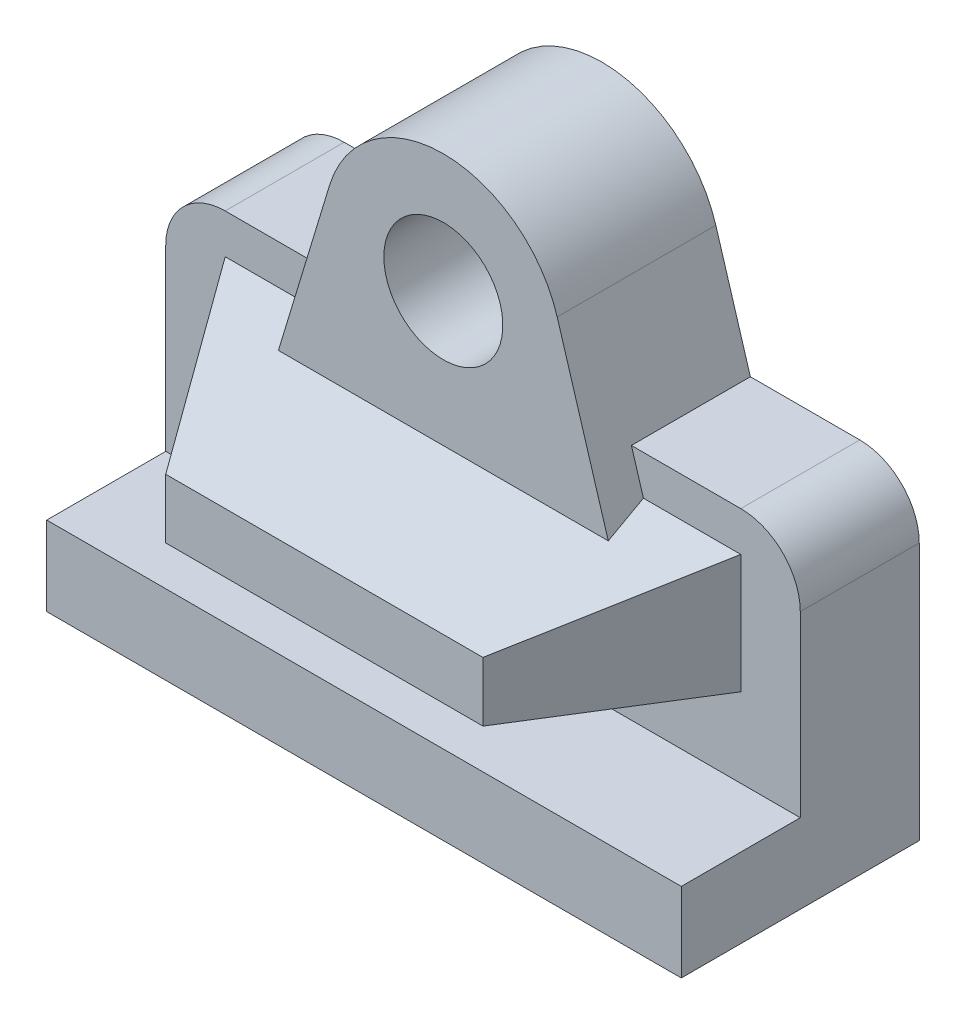
ISO-10303-21;
HEADER;
FILE_DESCRIPTION(('STEP AP214'),'2;1');
FILE_NAME('part.step','',(''),(''),'','','');
FILE_SCHEMA(('AUTOMOTIVE_DESIGN { 1 0 10303 214 1 1 1 1 }'));
ENDSEC;
DATA;
#1=APPLICATION_CONTEXT('core data for automotive mechanical design processes');
#2=APPLICATION_PROTOCOL_DEFINITION('international standard','automotive_design',2000,#1);
#3=PRODUCT_CONTEXT('',#1,'mechanical');
#4=PRODUCT('Part','Part','',(#3));
#5=PRODUCT_RELATED_PRODUCT_CATEGORY('part','',(#4));
#6=PRODUCT_DEFINITION_FORMATION('','',#4);
#7=PRODUCT_DEFINITION_CONTEXT('part definition',#1,'design');
#8=PRODUCT_DEFINITION('design','',#6,#7);
#9=PRODUCT_DEFINITION_SHAPE('','',#8);
#10=(LENGTH_UNIT() NAMED_UNIT(*) SI_UNIT(.MILLI.,.METRE.));
#11=(NAMED_UNIT(*) PLANE_ANGLE_UNIT() SI_UNIT($,.RADIAN.));
#12=(NAMED_UNIT(*) SI_UNIT($,.STERADIAN.) SOLID_ANGLE_UNIT());
#13=UNCERTAINTY_MEASURE_WITH_UNIT(LENGTH_MEASURE(1.E-05),#10,'distance_accuracy_value','');
#14=(GEOMETRIC_REPRESENTATION_CONTEXT(3) GLOBAL_UNCERTAINTY_ASSIGNED_CONTEXT((#13)) GLOBAL_UNIT_ASSIGNED_CONTEXT((#10,
#11,#12)) REPRESENTATION_CONTEXT('',''));
#15=CARTESIAN_POINT('',(0.,0.,0.));
#16=DIRECTION('',(0.,0.,1.));
#17=DIRECTION('',(1.,0.,0.));
#18=AXIS2_PLACEMENT_3D('',#15,#16,#17);
#19=CARTESIAN_POINT('',(-35.8686510918962,10.8802906407689,19.05));
#20=DIRECTION('',(0.956942897795657,-0.29027623112899,0.));
#21=DIRECTION('',(0.29027623112899,0.956942897795657,0.));
#22=AXIS2_PLACEMENT_3D('',#19,#20,#21);
#23=PLANE('',#22);
#24=DIRECTION('',(0.105909715480469,0.349148635568292,-0.931063028182113));
#25=VECTOR('',#24,1.);
#26=CARTESIAN_POINT('',(-27.0412838186963,39.9811453179426,30.9669458188198));
#27=LINE('',#26,#25);
#28=CARTESIAN_POINT('',(-26.4080359827065,42.06875,25.4));
#29=VERTEX_POINT('',#28);
#30=CARTESIAN_POINT('',(-25.6857146436087,44.45,19.05));
#31=VERTEX_POINT('',#30);
#32=EDGE_CURVE('E291',#29,#31,#27,.T.);
#33=ORIENTED_EDGE('',*,*,#32,.F.);
#34=DIRECTION('',(-0.29027623112899,-0.956942897795657,0.));
#35=VECTOR('',#34,1.);
#36=CARTESIAN_POINT('',(-35.8686510918962,10.8802906407689,25.4));
#37=LINE('',#36,#35);
#38=CARTESIAN_POINT('',(-18.2297622030073,69.0297622030073,25.4));
#39=VERTEX_POINT('',#38);
#40=EDGE_CURVE('E267',#39,#29,#37,.T.);
#41=ORIENTED_EDGE('',*,*,#40,.F.);
#42=DIRECTION('',(0.,0.,-1.));
#43=VECTOR('',#42,1.);
#44=CARTESIAN_POINT('',(-18.2297622030073,69.0297622030073,19.05));
#45=LINE('',#44,#43);
#46=CARTESIAN_POINT('',(-18.2297622030073,69.0297622030073,0.));
#47=VERTEX_POINT('',#46);
#48=EDGE_CURVE('E152',#39,#47,#45,.T.);
#49=ORIENTED_EDGE('',*,*,#48,.T.);
#50=DIRECTION('',(-0.29027623112899,-0.956942897795657,0.));
#51=VECTOR('',#50,1.);
#52=CARTESIAN_POINT('',(-35.8686510918962,10.8802906407689,0.));
#53=LINE('',#52,#51);
#54=CARTESIAN_POINT('',(-23.7595244060145,50.8,0.));
#55=VERTEX_POINT('',#54);
#56=EDGE_CURVE('E158',#47,#55,#53,.T.);
#57=ORIENTED_EDGE('',*,*,#56,.T.);
#58=DIRECTION('',(0.,0.,-1.));
#59=VECTOR('',#58,1.);
#60=CARTESIAN_POINT('',(-23.7595244060145,50.8,19.05));
#61=LINE('',#60,#59);
#62=CARTESIAN_POINT('',(-23.7595244060145,50.8,19.05));
#63=VERTEX_POINT('',#62);
#64=EDGE_CURVE('E51',#63,#55,#61,.T.);
#65=ORIENTED_EDGE('',*,*,#64,.F.);
#66=DIRECTION('',(0.29027623112899,0.956942897795657,0.));
#67=VECTOR('',#66,1.);
#68=CARTESIAN_POINT('',(-35.8686510918962,10.8802906407689,19.05));
#69=LINE('',#68,#67);
#70=EDGE_CURVE('E108',#31,#63,#69,.T.);
#71=ORIENTED_EDGE('',*,*,#70,.F.);
#72=EDGE_LOOP('',(#33,#41,#49,#57,#65,#71));
#73=FACE_BOUND('',#72,.T.);
#74=ADVANCED_FACE('F43',(#73),#23,.F.);
#75=CARTESIAN_POINT('',(35.8686510918962,10.8802906407689,19.05));
#76=DIRECTION('',(0.956942897795657,0.29027623112899,0.));
#77=DIRECTION('',(-0.29027623112899,0.956942897795657,0.));
#78=AXIS2_PLACEMENT_3D('',#75,#76,#77);
#79=PLANE('',#78);
#80=DIRECTION('',(0.29027623112899,-0.956942897795657,0.));
#81=VECTOR('',#80,1.);
#82=CARTESIAN_POINT('',(35.8686510918962,10.8802906407689,25.4));
#83=LINE('',#82,#81);
#84=CARTESIAN_POINT('',(18.2297622030073,69.0297622030073,25.4));
#85=VERTEX_POINT('',#84);
#86=CARTESIAN_POINT('',(26.4080359827065,42.06875,25.4));
#87=VERTEX_POINT('',#86);
#88=EDGE_CURVE('E256',#85,#87,#83,.T.);
#89=ORIENTED_EDGE('',*,*,#88,.T.);
#90=DIRECTION('',(-0.105909715480469,0.349148635568292,-0.931063028182113));
#91=VECTOR('',#90,1.);
#92=CARTESIAN_POINT('',(27.0412838186963,39.9811453179426,30.9669458188198));
#93=LINE('',#92,#91);
#94=CARTESIAN_POINT('',(25.6857146436087,44.45,19.05));
#95=VERTEX_POINT('',#94);
#96=EDGE_CURVE('E59',#87,#95,#93,.T.);
#97=ORIENTED_EDGE('',*,*,#96,.T.);
#98=DIRECTION('',(-0.29027623112899,0.956942897795657,0.));
#99=VECTOR('',#98,1.);
#100=CARTESIAN_POINT('',(35.8686510918962,10.8802906407689,19.05));
#101=LINE('',#100,#99);
#102=CARTESIAN_POINT('',(23.7595244060145,50.8,19.05));
#103=VERTEX_POINT('',#102);
#104=EDGE_CURVE('E66',#95,#103,#101,.T.);
#105=ORIENTED_EDGE('',*,*,#104,.T.);
#106=DIRECTION('',(0.,0.,-1.));
#107=VECTOR('',#106,1.);
#108=CARTESIAN_POINT('',(23.7595244060145,50.8,19.05));
#109=LINE('',#108,#107);
#110=CARTESIAN_POINT('',(23.7595244060145,50.8,0.));
#111=VERTEX_POINT('',#110);
#112=EDGE_CURVE('E187',#103,#111,#109,.T.);
#113=ORIENTED_EDGE('',*,*,#112,.T.);
#114=DIRECTION('',(0.29027623112899,-0.956942897795657,0.));
#115=VECTOR('',#114,1.);
#116=CARTESIAN_POINT('',(35.8686510918962,10.8802906407689,0.));
#117=LINE('',#116,#115);
#118=CARTESIAN_POINT('',(18.2297622030073,69.0297622030073,0.));
#119=VERTEX_POINT('',#118);
#120=EDGE_CURVE('E176',#119,#111,#117,.T.);
#121=ORIENTED_EDGE('',*,*,#120,.F.);
#122=DIRECTION('',(0.,0.,-1.));
#123=VECTOR('',#122,1.);
#124=CARTESIAN_POINT('',(18.2297622030073,69.0297622030073,19.05));
#125=LINE('',#124,#123);
#126=EDGE_CURVE('E185',#85,#119,#125,.T.);
#127=ORIENTED_EDGE('',*,*,#126,.F.);
#128=EDGE_LOOP('',(#89,#97,#105,#113,#121,#127));
#129=FACE_BOUND('',#128,.T.);
#130=ADVANCED_FACE('F461',(#129),#79,.T.);
#131=CARTESIAN_POINT('',(0.,0.,19.05));
#132=DIRECTION('',(0.,0.,1.));
#133=DIRECTION('',(1.,0.,0.));
#134=AXIS2_PLACEMENT_3D('',#131,#132,#133);
#135=PLANE('',#134);
#136=DIRECTION('',(0.,-1.,0.));
#137=VECTOR('',#136,1.);
#138=CARTESIAN_POINT('',(-41.275,44.45,19.05));
#139=LINE('',#138,#137);
#140=CARTESIAN_POINT('',(-41.275,44.45,19.05));
#141=VERTEX_POINT('',#140);
#142=CARTESIAN_POINT('',(-41.275,25.4,19.05));
#143=VERTEX_POINT('',#142);
#144=EDGE_CURVE('E343',#141,#143,#139,.T.);
#145=ORIENTED_EDGE('',*,*,#144,.F.);
#146=DIRECTION('',(-1.,0.,0.));
#147=VECTOR('',#146,1.);
#148=CARTESIAN_POINT('',(-41.275,44.45,19.05));
#149=LINE('',#148,#147);
#150=EDGE_CURVE('E332',#31,#141,#149,.T.);
#151=ORIENTED_EDGE('',*,*,#150,.F.);
#152=ORIENTED_EDGE('',*,*,#70,.T.);
#153=DIRECTION('',(1.,0.,0.));
#154=VECTOR('',#153,1.);
#155=CARTESIAN_POINT('',(0.,50.8,19.05));
#156=LINE('',#155,#154);
#157=CARTESIAN_POINT('',(-41.275,50.8,19.05));
#158=VERTEX_POINT('',#157);
#159=EDGE_CURVE('E183',#158,#63,#156,.T.);
#160=ORIENTED_EDGE('',*,*,#159,.F.);
#161=CARTESIAN_POINT('',(-41.275,41.275,19.05));
#162=DIRECTION('',(0.,0.,1.));
#163=DIRECTION('',(1.,0.,0.));
#164=AXIS2_PLACEMENT_3D('',#161,#162,#163);
#165=CIRCLE('',#164,9.525);
#166=CARTESIAN_POINT('',(-50.8,41.275,19.05));
#167=VERTEX_POINT('',#166);
#168=EDGE_CURVE('E198',#167,#158,#165,.F.);
#169=ORIENTED_EDGE('',*,*,#168,.F.);
#170=DIRECTION('',(0.,1.,0.));
#171=VECTOR('',#170,1.);
#172=CARTESIAN_POINT('',(-50.8,0.,19.05));
#173=LINE('',#172,#171);
#174=CARTESIAN_POINT('',(-50.8,12.7,19.05));
#175=VERTEX_POINT('',#174);
#176=EDGE_CURVE('E195',#175,#167,#173,.T.);
#177=ORIENTED_EDGE('',*,*,#176,.F.);
#178=DIRECTION('',(-1.,0.,0.));
#179=VECTOR('',#178,1.);
#180=CARTESIAN_POINT('',(0.,12.7,19.05));
#181=LINE('',#180,#179);
#182=CARTESIAN_POINT('',(50.8,12.7,19.05));
#183=VERTEX_POINT('',#182);
#184=EDGE_CURVE('E131',#183,#175,#181,.T.);
#185=ORIENTED_EDGE('',*,*,#184,.F.);
#186=DIRECTION('',(0.,1.,0.));
#187=VECTOR('',#186,1.);
#188=CARTESIAN_POINT('',(50.8,0.,19.05));
#189=LINE('',#188,#187);
#190=CARTESIAN_POINT('',(50.8,41.275,19.05));
#191=VERTEX_POINT('',#190);
#192=EDGE_CURVE('E122',#183,#191,#189,.T.);
#193=ORIENTED_EDGE('',*,*,#192,.T.);
#194=CARTESIAN_POINT('',(41.275,41.275,19.05));
#195=DIRECTION('',(0.,0.,1.));
#196=DIRECTION('',(1.,0.,0.));
#197=AXIS2_PLACEMENT_3D('',#194,#195,#196);
#198=CIRCLE('',#197,9.525);
#199=CARTESIAN_POINT('',(41.275,50.8,19.05));
#200=VERTEX_POINT('',#199);
#201=EDGE_CURVE('E127',#191,#200,#198,.T.);
#202=ORIENTED_EDGE('',*,*,#201,.T.);
#203=DIRECTION('',(-1.,0.,0.));
#204=VECTOR('',#203,1.);
#205=CARTESIAN_POINT('',(0.,50.8,19.05));
#206=LINE('',#205,#204);
#207=EDGE_CURVE('E150',#200,#103,#206,.T.);
#208=ORIENTED_EDGE('',*,*,#207,.T.);
#209=ORIENTED_EDGE('',*,*,#104,.F.);
#210=CARTESIAN_POINT('',(41.275,44.45,19.05));
#211=VERTEX_POINT('',#210);
#212=EDGE_CURVE('E337',#211,#95,#149,.T.);
#213=ORIENTED_EDGE('',*,*,#212,.F.);
#214=DIRECTION('',(0.,1.,0.));
#215=VECTOR('',#214,1.);
#216=CARTESIAN_POINT('',(41.275,25.4,19.05));
#217=LINE('',#216,#215);
#218=CARTESIAN_POINT('',(41.275,25.4,19.05));
#219=VERTEX_POINT('',#218);
#220=EDGE_CURVE('E338',#219,#211,#217,.T.);
#221=ORIENTED_EDGE('',*,*,#220,.F.);
#222=DIRECTION('',(1.,0.,0.));
#223=VECTOR('',#222,1.);
#224=CARTESIAN_POINT('',(-41.275,25.4,19.05));
#225=LINE('',#224,#223);
#226=EDGE_CURVE('E353',#143,#219,#225,.T.);
#227=ORIENTED_EDGE('',*,*,#226,.F.);
#228=EDGE_LOOP('',(#145,#151,#152,#160,#169,#177,#185,#193,#202,#208,#209,#213,#221,#227));
#229=FACE_BOUND('',#228,.T.);
#230=ADVANCED_FACE('F125',(#229),#135,.T.);
#231=CARTESIAN_POINT('',(0.,0.,25.4));
#232=DIRECTION('',(0.,0.,1.));
#233=DIRECTION('',(1.,0.,0.));
#234=AXIS2_PLACEMENT_3D('',#231,#232,#233);
#235=PLANE('',#234);
#236=CARTESIAN_POINT('',(0.,63.5,25.4));
#237=DIRECTION('',(0.,0.,1.));
#238=DIRECTION('',(1.,0.,0.));
#239=AXIS2_PLACEMENT_3D('',#236,#237,#238);
#240=CIRCLE('',#239,9.52500000000001);
#241=CARTESIAN_POINT('',(-9.52500000000001,63.5,25.4));
#242=VERTEX_POINT('',#241);
#243=EDGE_CURVE('E271',#242,#242,#240,.T.);
#244=ORIENTED_EDGE('',*,*,#243,.F.);
#245=EDGE_LOOP('',(#244));
#246=FACE_BOUND('',#245,.T.);
#247=ORIENTED_EDGE('',*,*,#40,.T.);
#248=DIRECTION('',(1.,0.,0.));
#249=VECTOR('',#248,1.);
#250=CARTESIAN_POINT('',(0.,42.06875,25.4));
#251=LINE('',#250,#249);
#252=EDGE_CURVE('E12',#29,#87,#251,.T.);
#253=ORIENTED_EDGE('',*,*,#252,.T.);
#254=ORIENTED_EDGE('',*,*,#88,.F.);
#255=CARTESIAN_POINT('',(0.,63.5,25.4));
#256=DIRECTION('',(0.,0.,1.));
#257=DIRECTION('',(1.,0.,0.));
#258=AXIS2_PLACEMENT_3D('',#255,#256,#257);
#259=CIRCLE('',#258,19.05);
#260=EDGE_CURVE('E263',#85,#39,#259,.T.);
#261=ORIENTED_EDGE('',*,*,#260,.T.);
#262=EDGE_LOOP('',(#247,#253,#254,#261));
#263=FACE_BOUND('',#262,.T.);
#264=ADVANCED_FACE('F277',(#246,#263),#235,.T.);
#265=CARTESIAN_POINT('',(0.,50.8,19.05));
#266=DIRECTION('',(0.,1.,0.));
#267=DIRECTION('',(0.,0.,1.));
#268=AXIS2_PLACEMENT_3D('',#265,#266,#267);
#269=PLANE('',#268);
#270=DIRECTION('',(1.,0.,0.));
#271=VECTOR('',#270,1.);
#272=CARTESIAN_POINT('',(0.,50.8,0.));
#273=LINE('',#272,#271);
#274=CARTESIAN_POINT('',(-41.275,50.8,0.));
#275=VERTEX_POINT('',#274);
#276=EDGE_CURVE('E161',#275,#55,#273,.T.);
#277=ORIENTED_EDGE('',*,*,#276,.F.);
#278=DIRECTION('',(0.,0.,-1.));
#279=VECTOR('',#278,1.);
#280=CARTESIAN_POINT('',(-41.275,50.8,19.05));
#281=LINE('',#280,#279);
#282=EDGE_CURVE('E191',#158,#275,#281,.T.);
#283=ORIENTED_EDGE('',*,*,#282,.F.);
#284=ORIENTED_EDGE('',*,*,#159,.T.);
#285=ORIENTED_EDGE('',*,*,#64,.T.);
#286=EDGE_LOOP('',(#277,#283,#284,#285));
#287=FACE_BOUND('',#286,.T.);
#288=ADVANCED_FACE('F280',(#287),#269,.T.);
#289=CARTESIAN_POINT('',(-41.275,41.275,19.05));
#290=DIRECTION('',(0.,0.,-1.));
#291=DIRECTION('',(-1.,0.,0.));
#292=AXIS2_PLACEMENT_3D('',#289,#290,#291);
#293=CYLINDRICAL_SURFACE('',#292,9.525);
#294=CARTESIAN_POINT('',(-41.275,41.275,0.));
#295=DIRECTION('',(0.,0.,1.));
#296=DIRECTION('',(1.,0.,0.));
#297=AXIS2_PLACEMENT_3D('',#294,#295,#296);
#298=CIRCLE('',#297,9.525);
#299=CARTESIAN_POINT('',(-50.8,41.275,0.));
#300=VERTEX_POINT('',#299);
#301=EDGE_CURVE('E164',#300,#275,#298,.F.);
#302=ORIENTED_EDGE('',*,*,#301,.F.);
#303=DIRECTION('',(0.,0.,-1.));
#304=VECTOR('',#303,1.);
#305=CARTESIAN_POINT('',(-50.8,41.275,19.05));
#306=LINE('',#305,#304);
#307=EDGE_CURVE('E144',#167,#300,#306,.T.);
#308=ORIENTED_EDGE('',*,*,#307,.F.);
#309=ORIENTED_EDGE('',*,*,#168,.T.);
#310=ORIENTED_EDGE('',*,*,#282,.T.);
#311=EDGE_LOOP('',(#302,#308,#309,#310));
#312=FACE_BOUND('',#311,.T.);
#313=ADVANCED_FACE('F216',(#312),#293,.T.);
#314=CARTESIAN_POINT('',(-50.8,0.,19.05));
#315=DIRECTION('',(-1.,0.,0.));
#316=DIRECTION('',(0.,0.,1.));
#317=AXIS2_PLACEMENT_3D('',#314,#315,#316);
#318=PLANE('',#317);
#319=DIRECTION('',(0.,1.,0.));
#320=VECTOR('',#319,1.);
#321=CARTESIAN_POINT('',(-50.8,0.,0.));
#322=LINE('',#321,#320);
#323=CARTESIAN_POINT('',(-50.8,0.,0.));
#324=VERTEX_POINT('',#323);
#325=EDGE_CURVE('E167',#324,#300,#322,.T.);
#326=ORIENTED_EDGE('',*,*,#325,.F.);
#327=DIRECTION('',(0.,0.,-1.));
#328=VECTOR('',#327,1.);
#329=CARTESIAN_POINT('',(-50.8,0.,38.1));
#330=LINE('',#329,#328);
#331=CARTESIAN_POINT('',(-50.8,0.,38.1));
#332=VERTEX_POINT('',#331);
#333=EDGE_CURVE('E244',#332,#324,#330,.T.);
#334=ORIENTED_EDGE('',*,*,#333,.F.);
#335=DIRECTION('',(0.,1.,0.));
#336=VECTOR('',#335,1.);
#337=CARTESIAN_POINT('',(-50.8,0.,38.1));
#338=LINE('',#337,#336);
#339=CARTESIAN_POINT('',(-50.8,12.7,38.1));
#340=VERTEX_POINT('',#339);
#341=EDGE_CURVE('E229',#332,#340,#338,.T.);
#342=ORIENTED_EDGE('',*,*,#341,.T.);
#343=DIRECTION('',(0.,0.,-1.));
#344=VECTOR('',#343,1.);
#345=CARTESIAN_POINT('',(-50.8,12.7,38.1));
#346=LINE('',#345,#344);
#347=EDGE_CURVE('E225',#340,#175,#346,.T.);
#348=ORIENTED_EDGE('',*,*,#347,.T.);
#349=ORIENTED_EDGE('',*,*,#176,.T.);
#350=ORIENTED_EDGE('',*,*,#307,.T.);
#351=EDGE_LOOP('',(#326,#334,#342,#348,#349,#350));
#352=FACE_BOUND('',#351,.T.);
#353=ADVANCED_FACE('F222',(#352),#318,.T.);
#354=CARTESIAN_POINT('',(50.8,0.,19.05));
#355=DIRECTION('',(-1.,0.,0.));
#356=DIRECTION('',(0.,0.,1.));
#357=AXIS2_PLACEMENT_3D('',#354,#355,#356);
#358=PLANE('',#357);
#359=DIRECTION('',(0.,1.,0.));
#360=VECTOR('',#359,1.);
#361=CARTESIAN_POINT('',(50.8,0.,0.));
#362=LINE('',#361,#360);
#363=CARTESIAN_POINT('',(50.8,0.,0.));
#364=VERTEX_POINT('',#363);
#365=CARTESIAN_POINT('',(50.8,41.275,0.));
#366=VERTEX_POINT('',#365);
#367=EDGE_CURVE('E141',#364,#366,#362,.T.);
#368=ORIENTED_EDGE('',*,*,#367,.T.);
#369=DIRECTION('',(0.,0.,-1.));
#370=VECTOR('',#369,1.);
#371=CARTESIAN_POINT('',(50.8,41.275,19.05));
#372=LINE('',#371,#370);
#373=EDGE_CURVE('E137',#191,#366,#372,.T.);
#374=ORIENTED_EDGE('',*,*,#373,.F.);
#375=ORIENTED_EDGE('',*,*,#192,.F.);
#376=DIRECTION('',(0.,0.,-1.));
#377=VECTOR('',#376,1.);
#378=CARTESIAN_POINT('',(50.8,12.7,38.1));
#379=LINE('',#378,#377);
#380=CARTESIAN_POINT('',(50.8,12.7,38.1));
#381=VERTEX_POINT('',#380);
#382=EDGE_CURVE('E234',#381,#183,#379,.T.);
#383=ORIENTED_EDGE('',*,*,#382,.F.);
#384=DIRECTION('',(0.,1.,0.));
#385=VECTOR('',#384,1.);
#386=CARTESIAN_POINT('',(50.8,0.,38.1));
#387=LINE('',#386,#385);
#388=CARTESIAN_POINT('',(50.8,0.,38.1));
#389=VERTEX_POINT('',#388);
#390=EDGE_CURVE('E240',#389,#381,#387,.T.);
#391=ORIENTED_EDGE('',*,*,#390,.F.);
#392=DIRECTION('',(0.,0.,-1.));
#393=VECTOR('',#392,1.);
#394=CARTESIAN_POINT('',(50.8,0.,38.1));
#395=LINE('',#394,#393);
#396=EDGE_CURVE('E237',#389,#364,#395,.T.);
#397=ORIENTED_EDGE('',*,*,#396,.T.);
#398=EDGE_LOOP('',(#368,#374,#375,#383,#391,#397));
#399=FACE_BOUND('',#398,.T.);
#400=ADVANCED_FACE('F138',(#399),#358,.F.);
#401=CARTESIAN_POINT('',(41.275,41.275,19.05));
#402=DIRECTION('',(0.,0.,-1.));
#403=DIRECTION('',(-1.,0.,0.));
#404=AXIS2_PLACEMENT_3D('',#401,#402,#403);
#405=CYLINDRICAL_SURFACE('',#404,9.525);
#406=CARTESIAN_POINT('',(41.275,41.275,0.));
#407=DIRECTION('',(0.,0.,1.));
#408=DIRECTION('',(1.,0.,0.));
#409=AXIS2_PLACEMENT_3D('',#406,#407,#408);
#410=CIRCLE('',#409,9.525);
#411=CARTESIAN_POINT('',(41.275,50.8,0.));
#412=VERTEX_POINT('',#411);
#413=EDGE_CURVE('E171',#366,#412,#410,.T.);
#414=ORIENTED_EDGE('',*,*,#413,.T.);
#415=DIRECTION('',(0.,0.,-1.));
#416=VECTOR('',#415,1.);
#417=CARTESIAN_POINT('',(41.275,50.8,19.05));
#418=LINE('',#417,#416);
#419=EDGE_CURVE('E145',#200,#412,#418,.T.);
#420=ORIENTED_EDGE('',*,*,#419,.F.);
#421=ORIENTED_EDGE('',*,*,#201,.F.);
#422=ORIENTED_EDGE('',*,*,#373,.T.);
#423=EDGE_LOOP('',(#414,#420,#421,#422));
#424=FACE_BOUND('',#423,.T.);
#425=ADVANCED_FACE('F147',(#424),#405,.T.);
#426=CARTESIAN_POINT('',(0.,50.8,19.05));
#427=DIRECTION('',(0.,-1.,0.));
#428=DIRECTION('',(0.,0.,-1.));
#429=AXIS2_PLACEMENT_3D('',#426,#427,#428);
#430=PLANE('',#429);
#431=DIRECTION('',(-1.,0.,0.));
#432=VECTOR('',#431,1.);
#433=CARTESIAN_POINT('',(0.,50.8,0.));
#434=LINE('',#433,#432);
#435=EDGE_CURVE('E173',#412,#111,#434,.T.);
#436=ORIENTED_EDGE('',*,*,#435,.T.);
#437=ORIENTED_EDGE('',*,*,#112,.F.);
#438=ORIENTED_EDGE('',*,*,#207,.F.);
#439=ORIENTED_EDGE('',*,*,#419,.T.);
#440=EDGE_LOOP('',(#436,#437,#438,#439));
#441=FACE_BOUND('',#440,.T.);
#442=ADVANCED_FACE('F474',(#441),#430,.F.);
#443=CARTESIAN_POINT('',(0.,63.5,19.05));
#444=DIRECTION('',(0.,0.,-1.));
#445=DIRECTION('',(-1.,0.,0.));
#446=AXIS2_PLACEMENT_3D('',#443,#444,#445);
#447=CYLINDRICAL_SURFACE('',#446,19.05);
#448=CARTESIAN_POINT('',(0.,63.5,0.));
#449=DIRECTION('',(0.,0.,1.));
#450=DIRECTION('',(1.,0.,0.));
#451=AXIS2_PLACEMENT_3D('',#448,#449,#450);
#452=CIRCLE('',#451,19.05);
#453=EDGE_CURVE('E99',#119,#47,#452,.T.);
#454=ORIENTED_EDGE('',*,*,#453,.T.);
#455=ORIENTED_EDGE('',*,*,#48,.F.);
#456=ORIENTED_EDGE('',*,*,#260,.F.);
#457=ORIENTED_EDGE('',*,*,#126,.T.);
#458=EDGE_LOOP('',(#454,#455,#456,#457));
#459=FACE_BOUND('',#458,.T.);
#460=ADVANCED_FACE('F472',(#459),#447,.T.);
#461=CARTESIAN_POINT('',(0.,63.5,19.05));
#462=DIRECTION('',(0.,0.,-1.));
#463=DIRECTION('',(-1.,0.,0.));
#464=AXIS2_PLACEMENT_3D('',#461,#462,#463);
#465=CYLINDRICAL_SURFACE('',#464,9.52500000000001);
#466=CARTESIAN_POINT('',(0.,63.5,0.));
#467=DIRECTION('',(0.,0.,1.));
#468=DIRECTION('',(1.,0.,0.));
#469=AXIS2_PLACEMENT_3D('',#466,#467,#468);
#470=CIRCLE('',#469,9.52500000000001);
#471=CARTESIAN_POINT('',(-9.52500000000001,63.5,0.));
#472=VERTEX_POINT('',#471);
#473=EDGE_CURVE('E180',#472,#472,#470,.T.);
#474=CARTESIAN_POINT('',(-9.52500000000001,63.5,0.));
#475=CARTESIAN_POINT('',(-9.52500000000001,63.5,0.264583333333333));
#476=CARTESIAN_POINT('',(-9.52500000000001,63.5,0.529166666666666));
#477=CARTESIAN_POINT('',(-9.52500000000001,63.5,1.05833333333333));
#478=CARTESIAN_POINT('',(-9.52500000000001,63.5,1.32291666666667));
#479=CARTESIAN_POINT('',(-9.52500000000001,63.5,1.85208333333333));
#480=CARTESIAN_POINT('',(-9.52500000000001,63.5,2.11666666666667));
#481=CARTESIAN_POINT('',(-9.52500000000001,63.5,2.64583333333333));
#482=CARTESIAN_POINT('',(-9.52500000000001,63.5,2.91041666666667));
#483=CARTESIAN_POINT('',(-9.52500000000001,63.5,3.43958333333333));
#484=CARTESIAN_POINT('',(-9.52500000000001,63.5,3.70416666666667));
#485=CARTESIAN_POINT('',(-9.52500000000001,63.5,4.23333333333333));
#486=CARTESIAN_POINT('',(-9.52500000000001,63.5,4.49791666666667));
#487=CARTESIAN_POINT('',(-9.52500000000001,63.5,5.02708333333333));
#488=CARTESIAN_POINT('',(-9.52500000000001,63.5,5.29166666666666));
#489=CARTESIAN_POINT('',(-9.52500000000001,63.5,5.82083333333333));
#490=CARTESIAN_POINT('',(-9.52500000000001,63.5,6.08541666666666));
#491=CARTESIAN_POINT('',(-9.52500000000001,63.5,6.61458333333333));
#492=CARTESIAN_POINT('',(-9.52500000000001,63.5,6.87916666666667));
#493=CARTESIAN_POINT('',(-9.52500000000001,63.5,7.40833333333333));
#494=CARTESIAN_POINT('',(-9.52500000000001,63.5,7.67291666666667));
#495=CARTESIAN_POINT('',(-9.52500000000001,63.5,8.20208333333333));
#496=CARTESIAN_POINT('',(-9.52500000000001,63.5,8.46666666666666));
#497=CARTESIAN_POINT('',(-9.52500000000001,63.5,8.99583333333333));
#498=CARTESIAN_POINT('',(-9.52500000000001,63.5,9.26041666666666));
#499=CARTESIAN_POINT('',(-9.52500000000001,63.5,9.78958333333333));
#500=CARTESIAN_POINT('',(-9.52500000000001,63.5,10.0541666666667));
#501=CARTESIAN_POINT('',(-9.52500000000001,63.5,10.5833333333333));
#502=CARTESIAN_POINT('',(-9.52500000000001,63.5,10.8479166666667));
#503=CARTESIAN_POINT('',(-9.52500000000001,63.5,11.3770833333333));
#504=CARTESIAN_POINT('',(-9.52500000000001,63.5,11.6416666666667));
#505=CARTESIAN_POINT('',(-9.52500000000001,63.5,12.1708333333333));
#506=CARTESIAN_POINT('',(-9.52500000000001,63.5,12.4354166666667));
#507=CARTESIAN_POINT('',(-9.52500000000001,63.5,12.9645833333333));
#508=CARTESIAN_POINT('',(-9.52500000000001,63.5,13.2291666666667));
#509=CARTESIAN_POINT('',(-9.52500000000001,63.5,13.7583333333333));
#510=CARTESIAN_POINT('',(-9.52500000000001,63.5,14.0229166666667));
#511=CARTESIAN_POINT('',(-9.52500000000001,63.5,14.5520833333333));
#512=CARTESIAN_POINT('',(-9.52500000000001,63.5,14.8166666666667));
#513=CARTESIAN_POINT('',(-9.52500000000001,63.5,15.3458333333333));
#514=CARTESIAN_POINT('',(-9.52500000000001,63.5,15.6104166666667));
#515=CARTESIAN_POINT('',(-9.52500000000001,63.5,16.1395833333333));
#516=CARTESIAN_POINT('',(-9.52500000000001,63.5,16.4041666666667));
#517=CARTESIAN_POINT('',(-9.52500000000001,63.5,16.9333333333333));
#518=CARTESIAN_POINT('',(-9.52500000000001,63.5,17.1979166666667));
#519=CARTESIAN_POINT('',(-9.52500000000001,63.5,17.7270833333333));
#520=CARTESIAN_POINT('',(-9.52500000000001,63.5,17.9916666666667));
#521=CARTESIAN_POINT('',(-9.52500000000001,63.5,18.5208333333333));
#522=CARTESIAN_POINT('',(-9.52500000000001,63.5,18.7854166666667));
#523=CARTESIAN_POINT('',(-9.52500000000001,63.5,19.3145833333333));
#524=CARTESIAN_POINT('',(-9.52500000000001,63.5,19.5791666666667));
#525=CARTESIAN_POINT('',(-9.52500000000001,63.5,20.1083333333333));
#526=CARTESIAN_POINT('',(-9.52500000000001,63.5,20.3729166666667));
#527=CARTESIAN_POINT('',(-9.52500000000001,63.5,20.9020833333333));
#528=CARTESIAN_POINT('',(-9.52500000000001,63.5,21.1666666666667));
#529=CARTESIAN_POINT('',(-9.52500000000001,63.5,21.6958333333333));
#530=CARTESIAN_POINT('',(-9.52500000000001,63.5,21.9604166666667));
#531=CARTESIAN_POINT('',(-9.52500000000001,63.5,22.4895833333333));
#532=CARTESIAN_POINT('',(-9.52500000000001,63.5,22.7541666666667));
#533=CARTESIAN_POINT('',(-9.52500000000001,63.5,23.2833333333333));
#534=CARTESIAN_POINT('',(-9.52500000000001,63.5,23.5479166666667));
#535=CARTESIAN_POINT('',(-9.52500000000001,63.5,24.0770833333333));
#536=CARTESIAN_POINT('',(-9.52500000000001,63.5,24.3416666666667));
#537=CARTESIAN_POINT('',(-9.52500000000001,63.5,24.8708333333333));
#538=CARTESIAN_POINT('',(-9.52500000000001,63.5,25.1354166666667));
#539=CARTESIAN_POINT('',(-9.52500000000001,63.5,25.4));
#540=B_SPLINE_CURVE_WITH_KNOTS('',3,(#474,#475,#476,#477,#478,#479,#480,#481,#482,#483,#484,
#485,#486,#487,#488,#489,#490,#491,#492,#493,#494,#495,#496,#497,#498,#499,#500,#501,#502,#503,
#504,#505,#506,#507,#508,#509,#510,#511,#512,#513,#514,#515,#516,#517,#518,#519,#520,#521,#522,
#523,#524,#525,#526,#527,#528,#529,#530,#531,#532,#533,#534,#535,#536,#537,#538,#539),
.UNSPECIFIED.,.F.,.F.,(4,2,2,2,2,2,2,2,2,2,2,2,2,2,2,2,2,2,2,2,2,2,2,2,2,2,2,2,2,2,2,2,4),(0.,
0.793749999999999,1.5875,2.38125,3.175,3.96875,4.7625,5.55625,6.35,7.14375,7.9375,8.73125,9.525,
10.31875,11.1125,11.90625,12.7,13.49375,14.2875,15.08125,15.875,16.66875,17.4625,18.25625,19.05,
19.84375,20.6375,21.43125,22.225,23.01875,23.8125,24.60625,25.4),.UNSPECIFIED.);
#541=EDGE_CURVE('BSEAM275',#472,#242,#540,.T.);
#542=ORIENTED_EDGE('',*,*,#473,.F.);
#543=ORIENTED_EDGE('',*,*,#243,.T.);
#544=ORIENTED_EDGE('',*,*,#541,.T.);
#545=ORIENTED_EDGE('',*,*,#541,.F.);
#546=EDGE_LOOP('',(#542,#544,#543,#545));
#547=FACE_BOUND('',#546,.T.);
#548=ADVANCED_FACE('F275',(#547),#465,.F.);
#549=CARTESIAN_POINT('',(0.,0.,0.));
#550=DIRECTION('',(0.,0.,1.));
#551=DIRECTION('',(1.,0.,0.));
#552=AXIS2_PLACEMENT_3D('',#549,#550,#551);
#553=PLANE('',#552);
#554=ORIENTED_EDGE('',*,*,#120,.T.);
#555=ORIENTED_EDGE('',*,*,#435,.F.);
#556=ORIENTED_EDGE('',*,*,#413,.F.);
#557=ORIENTED_EDGE('',*,*,#367,.F.);
#558=DIRECTION('',(1.,0.,0.));
#559=VECTOR('',#558,1.);
#560=CARTESIAN_POINT('',(0.,0.,0.));
#561=LINE('',#560,#559);
#562=EDGE_CURVE('E250',#324,#364,#561,.T.);
#563=ORIENTED_EDGE('',*,*,#562,.F.);
#564=ORIENTED_EDGE('',*,*,#325,.T.);
#565=ORIENTED_EDGE('',*,*,#301,.T.);
#566=ORIENTED_EDGE('',*,*,#276,.T.);
#567=ORIENTED_EDGE('',*,*,#56,.F.);
#568=ORIENTED_EDGE('',*,*,#453,.F.);
#569=EDGE_LOOP('',(#554,#555,#556,#557,#563,#564,#565,#566,#567,#568));
#570=FACE_BOUND('',#569,.T.);
#571=ORIENTED_EDGE('',*,*,#473,.T.);
#572=EDGE_LOOP('',(#571));
#573=FACE_BOUND('',#572,.T.);
#574=ADVANCED_FACE('F452',(#570,#573),#553,.F.);
#575=CARTESIAN_POINT('',(0.,12.7,38.1));
#576=DIRECTION('',(0.,-1.,0.));
#577=DIRECTION('',(0.,0.,-1.));
#578=AXIS2_PLACEMENT_3D('',#575,#576,#577);
#579=PLANE('',#578);
#580=ORIENTED_EDGE('',*,*,#382,.T.);
#581=ORIENTED_EDGE('',*,*,#184,.T.);
#582=ORIENTED_EDGE('',*,*,#347,.F.);
#583=DIRECTION('',(-1.,0.,0.));
#584=VECTOR('',#583,1.);
#585=CARTESIAN_POINT('',(0.,12.7,38.1));
#586=LINE('',#585,#584);
#587=EDGE_CURVE('E235',#381,#340,#586,.T.);
#588=ORIENTED_EDGE('',*,*,#587,.F.);
#589=EDGE_LOOP('',(#580,#581,#582,#588));
#590=FACE_BOUND('',#589,.T.);
#591=ADVANCED_FACE('F449',(#590),#579,.F.);
#592=CARTESIAN_POINT('',(0.,0.,38.1));
#593=DIRECTION('',(0.,1.,0.));
#594=DIRECTION('',(0.,0.,1.));
#595=AXIS2_PLACEMENT_3D('',#592,#593,#594);
#596=PLANE('',#595);
#597=ORIENTED_EDGE('',*,*,#562,.T.);
#598=ORIENTED_EDGE('',*,*,#396,.F.);
#599=DIRECTION('',(1.,0.,0.));
#600=VECTOR('',#599,1.);
#601=CARTESIAN_POINT('',(0.,0.,38.1));
#602=LINE('',#601,#600);
#603=EDGE_CURVE('E446',#332,#389,#602,.T.);
#604=ORIENTED_EDGE('',*,*,#603,.F.);
#605=ORIENTED_EDGE('',*,*,#333,.T.);
#606=EDGE_LOOP('',(#597,#598,#604,#605));
#607=FACE_BOUND('',#606,.T.);
#608=ADVANCED_FACE('F451',(#607),#596,.F.);
#609=CARTESIAN_POINT('',(0.,0.,38.1));
#610=DIRECTION('',(0.,0.,1.));
#611=DIRECTION('',(1.,0.,0.));
#612=AXIS2_PLACEMENT_3D('',#609,#610,#611);
#613=PLANE('',#612);
#614=ORIENTED_EDGE('',*,*,#341,.F.);
#615=ORIENTED_EDGE('',*,*,#603,.T.);
#616=ORIENTED_EDGE('',*,*,#390,.T.);
#617=ORIENTED_EDGE('',*,*,#587,.T.);
#618=EDGE_LOOP('',(#614,#615,#616,#617));
#619=FACE_BOUND('',#618,.T.);
#620=ADVANCED_FACE('F411',(#619),#613,.T.);
#621=CARTESIAN_POINT('',(0.,45.2328767123288,16.9623287671233));
#622=DIRECTION('',(0.,-0.936329177569045,-0.351123441588392));
#623=DIRECTION('',(0.,0.351123441588392,-0.936329177569045));
#624=AXIS2_PLACEMENT_3D('',#621,#622,#623);
#625=PLANE('',#624);
#626=ORIENTED_EDGE('',*,*,#252,.F.);
#627=ORIENTED_EDGE('',*,*,#32,.T.);
#628=ORIENTED_EDGE('',*,*,#150,.T.);
#629=DIRECTION('',(0.505076272276105,-0.303045763365663,0.808122035641769));
#630=VECTOR('',#629,1.);
#631=CARTESIAN_POINT('',(-41.275,44.45,19.05));
#632=LINE('',#631,#630);
#633=CARTESIAN_POINT('',(-25.4,34.925,44.45));
#634=VERTEX_POINT('',#633);
#635=EDGE_CURVE('E336',#141,#634,#632,.T.);
#636=ORIENTED_EDGE('',*,*,#635,.T.);
#637=DIRECTION('',(-1.,0.,0.));
#638=VECTOR('',#637,1.);
#639=CARTESIAN_POINT('',(-25.4,34.925,44.45));
#640=LINE('',#639,#638);
#641=CARTESIAN_POINT('',(25.4,34.925,44.45));
#642=VERTEX_POINT('',#641);
#643=EDGE_CURVE('E368',#642,#634,#640,.T.);
#644=ORIENTED_EDGE('',*,*,#643,.F.);
#645=DIRECTION('',(-0.505076272276105,-0.303045763365663,0.808122035641769));
#646=VECTOR('',#645,1.);
#647=CARTESIAN_POINT('',(41.275,44.45,19.05));
#648=LINE('',#647,#646);
#649=EDGE_CURVE('E365',#211,#642,#648,.T.);
#650=ORIENTED_EDGE('',*,*,#649,.F.);
#651=ORIENTED_EDGE('',*,*,#212,.T.);
#652=ORIENTED_EDGE('',*,*,#96,.F.);
#653=EDGE_LOOP('',(#626,#627,#628,#636,#644,#650,#651,#652));
#654=FACE_BOUND('',#653,.T.);
#655=ADVANCED_FACE('F334',(#654),#625,.F.);
#656=CARTESIAN_POINT('',(0.,0.,44.45));
#657=DIRECTION('',(0.,0.,-1.));
#658=DIRECTION('',(-1.,0.,0.));
#659=AXIS2_PLACEMENT_3D('',#656,#657,#658);
#660=PLANE('',#659);
#661=DIRECTION('',(0.,-1.,0.));
#662=VECTOR('',#661,1.);
#663=CARTESIAN_POINT('',(-25.4,25.4,44.45));
#664=LINE('',#663,#662);
#665=CARTESIAN_POINT('',(-25.4,25.4,44.45));
#666=VERTEX_POINT('',#665);
#667=EDGE_CURVE('E346',#634,#666,#664,.T.);
#668=ORIENTED_EDGE('',*,*,#667,.T.);
#669=DIRECTION('',(1.,0.,0.));
#670=VECTOR('',#669,1.);
#671=CARTESIAN_POINT('',(-25.4,25.4,44.45));
#672=LINE('',#671,#670);
#673=CARTESIAN_POINT('',(25.4,25.4,44.45));
#674=VERTEX_POINT('',#673);
#675=EDGE_CURVE('E385',#666,#674,#672,.T.);
#676=ORIENTED_EDGE('',*,*,#675,.T.);
#677=DIRECTION('',(0.,1.,0.));
#678=VECTOR('',#677,1.);
#679=CARTESIAN_POINT('',(25.4,25.4,44.45));
#680=LINE('',#679,#678);
#681=EDGE_CURVE('E388',#674,#642,#680,.T.);
#682=ORIENTED_EDGE('',*,*,#681,.T.);
#683=ORIENTED_EDGE('',*,*,#643,.T.);
#684=EDGE_LOOP('',(#668,#676,#682,#683));
#685=FACE_BOUND('',#684,.T.);
#686=ADVANCED_FACE('F399',(#685),#660,.F.);
#687=CARTESIAN_POINT('',(-38.2426966292135,0.,23.9016853932584));
#688=DIRECTION('',(0.847998304005088,0.,-0.52999894000318));
#689=DIRECTION('',(-0.52999894000318,0.,-0.847998304005088));
#690=AXIS2_PLACEMENT_3D('',#687,#688,#689);
#691=PLANE('',#690);
#692=DIRECTION('',(0.52999894000318,0.,0.847998304005088));
#693=VECTOR('',#692,1.);
#694=CARTESIAN_POINT('',(-41.275,25.4,19.05));
#695=LINE('',#694,#693);
#696=EDGE_CURVE('E349',#143,#666,#695,.T.);
#697=ORIENTED_EDGE('',*,*,#696,.T.);
#698=ORIENTED_EDGE('',*,*,#667,.F.);
#699=ORIENTED_EDGE('',*,*,#635,.F.);
#700=ORIENTED_EDGE('',*,*,#144,.T.);
#701=EDGE_LOOP('',(#697,#698,#699,#700));
#702=FACE_BOUND('',#701,.T.);
#703=ADVANCED_FACE('F342',(#702),#691,.F.);
#704=CARTESIAN_POINT('',(0.,25.4,0.));
#705=DIRECTION('',(0.,1.,0.));
#706=DIRECTION('',(-1.,0.,0.));
#707=AXIS2_PLACEMENT_3D('',#704,#705,#706);
#708=PLANE('',#707);
#709=DIRECTION('',(-0.52999894000318,0.,0.847998304005088));
#710=VECTOR('',#709,1.);
#711=CARTESIAN_POINT('',(41.275,25.4,19.05));
#712=LINE('',#711,#710);
#713=EDGE_CURVE('E348',#219,#674,#712,.T.);
#714=ORIENTED_EDGE('',*,*,#713,.T.);
#715=ORIENTED_EDGE('',*,*,#675,.F.);
#716=ORIENTED_EDGE('',*,*,#696,.F.);
#717=ORIENTED_EDGE('',*,*,#226,.T.);
#718=EDGE_LOOP('',(#714,#715,#716,#717));
#719=FACE_BOUND('',#718,.T.);
#720=ADVANCED_FACE('F632',(#719),#708,.F.);
#721=CARTESIAN_POINT('',(38.2426966292135,0.,23.9016853932584));
#722=DIRECTION('',(-0.847998304005088,0.,-0.52999894000318));
#723=DIRECTION('',(-0.52999894000318,0.,0.847998304005088));
#724=AXIS2_PLACEMENT_3D('',#721,#722,#723);
#725=PLANE('',#724);
#726=ORIENTED_EDGE('',*,*,#649,.T.);
#727=ORIENTED_EDGE('',*,*,#681,.F.);
#728=ORIENTED_EDGE('',*,*,#713,.F.);
#729=ORIENTED_EDGE('',*,*,#220,.T.);
#730=EDGE_LOOP('',(#726,#727,#728,#729));
#731=FACE_BOUND('',#730,.T.);
#732=ADVANCED_FACE('F363',(#731),#725,.F.);
#733=CLOSED_SHELL('',(#74,#130,#230,#264,#288,#313,#353,#400,#425,#442,#460,#548,#574,#591,#608,
#620,#655,#686,#703,#720,#732));
#734=MANIFOLD_SOLID_BREP('B2',#733);
#735=ADVANCED_BREP_SHAPE_REPRESENTATION('',(#18,#734),#14);
#736=SHAPE_DEFINITION_REPRESENTATION(#9,#735);
ENDSEC;
END-ISO-10303-21;
